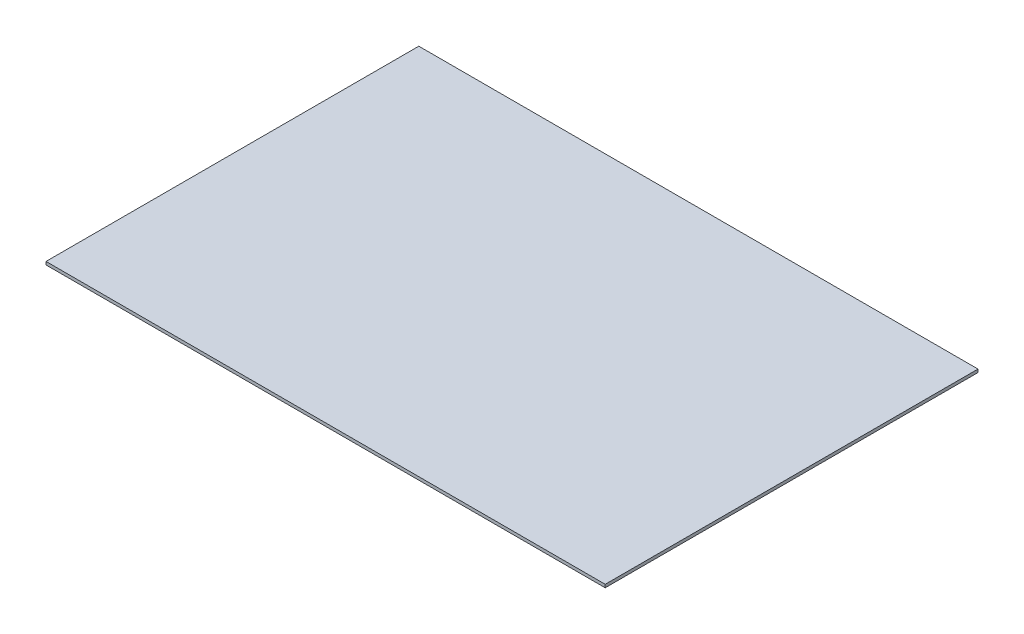
ISO-10303-21;
HEADER;
FILE_DESCRIPTION(('STEP AP214'),'2;1');
FILE_NAME('part.step','',(''),(''),'','','');
FILE_SCHEMA(('AUTOMOTIVE_DESIGN { 1 0 10303 214 1 1 1 1 }'));
ENDSEC;
DATA;
#1=APPLICATION_CONTEXT('core data for automotive mechanical design processes');
#2=APPLICATION_PROTOCOL_DEFINITION('international standard','automotive_design',2000,#1);
#3=PRODUCT_CONTEXT('',#1,'mechanical');
#4=PRODUCT('Part','Part','',(#3));
#5=PRODUCT_RELATED_PRODUCT_CATEGORY('part','',(#4));
#6=PRODUCT_DEFINITION_FORMATION('','',#4);
#7=PRODUCT_DEFINITION_CONTEXT('part definition',#1,'design');
#8=PRODUCT_DEFINITION('design','',#6,#7);
#9=PRODUCT_DEFINITION_SHAPE('','',#8);
#10=(LENGTH_UNIT() NAMED_UNIT(*) SI_UNIT(.MILLI.,.METRE.));
#11=(NAMED_UNIT(*) PLANE_ANGLE_UNIT() SI_UNIT($,.RADIAN.));
#12=(NAMED_UNIT(*) SI_UNIT($,.STERADIAN.) SOLID_ANGLE_UNIT());
#13=UNCERTAINTY_MEASURE_WITH_UNIT(LENGTH_MEASURE(1.E-05),#10,'distance_accuracy_value','');
#14=(GEOMETRIC_REPRESENTATION_CONTEXT(3) GLOBAL_UNCERTAINTY_ASSIGNED_CONTEXT((#13)) GLOBAL_UNIT_ASSIGNED_CONTEXT((#10,
#11,#12)) REPRESENTATION_CONTEXT('',''));
#15=CARTESIAN_POINT('',(0.,0.,0.));
#16=DIRECTION('',(0.,0.,1.));
#17=DIRECTION('',(1.,0.,0.));
#18=AXIS2_PLACEMENT_3D('',#15,#16,#17);
#19=CARTESIAN_POINT('',(914.4,10.,609.6));
#20=DIRECTION('',(-1.,0.,0.));
#21=DIRECTION('',(0.,0.,1.));
#22=AXIS2_PLACEMENT_3D('',#19,#20,#21);
#23=PLANE('',#22);
#24=DIRECTION('',(0.,0.,-1.));
#25=VECTOR('',#24,1.);
#26=CARTESIAN_POINT('',(914.4,0.,609.6));
#27=LINE('',#26,#25);
#28=CARTESIAN_POINT('',(914.4,0.,609.6));
#29=VERTEX_POINT('',#28);
#30=CARTESIAN_POINT('',(914.4,0.,-609.6));
#31=VERTEX_POINT('',#30);
#32=EDGE_CURVE('E98',#29,#31,#27,.T.);
#33=ORIENTED_EDGE('',*,*,#32,.T.);
#34=DIRECTION('',(0.,-1.,0.));
#35=VECTOR('',#34,1.);
#36=CARTESIAN_POINT('',(914.4,10.,-609.6));
#37=LINE('',#36,#35);
#38=CARTESIAN_POINT('',(914.4,10.,-609.6));
#39=VERTEX_POINT('',#38);
#40=EDGE_CURVE('E11',#39,#31,#37,.T.);
#41=ORIENTED_EDGE('',*,*,#40,.F.);
#42=DIRECTION('',(0.,0.,-1.));
#43=VECTOR('',#42,1.);
#44=CARTESIAN_POINT('',(914.4,10.,609.6));
#45=LINE('',#44,#43);
#46=CARTESIAN_POINT('',(914.4,10.,609.6));
#47=VERTEX_POINT('',#46);
#48=EDGE_CURVE('E86',#47,#39,#45,.T.);
#49=ORIENTED_EDGE('',*,*,#48,.F.);
#50=DIRECTION('',(0.,-1.,0.));
#51=VECTOR('',#50,1.);
#52=CARTESIAN_POINT('',(914.4,10.,609.6));
#53=LINE('',#52,#51);
#54=EDGE_CURVE('E94',#47,#29,#53,.T.);
#55=ORIENTED_EDGE('',*,*,#54,.T.);
#56=EDGE_LOOP('',(#33,#41,#49,#55));
#57=FACE_BOUND('',#56,.T.);
#58=ADVANCED_FACE('F35',(#57),#23,.F.);
#59=CARTESIAN_POINT('',(-914.4,10.,-609.6));
#60=DIRECTION('',(0.,0.,1.));
#61=DIRECTION('',(1.,0.,0.));
#62=AXIS2_PLACEMENT_3D('',#59,#60,#61);
#63=PLANE('',#62);
#64=DIRECTION('',(-1.,0.,0.));
#65=VECTOR('',#64,1.);
#66=CARTESIAN_POINT('',(-914.4,0.,-609.6));
#67=LINE('',#66,#65);
#68=CARTESIAN_POINT('',(-914.4,0.,-609.6));
#69=VERTEX_POINT('',#68);
#70=EDGE_CURVE('E90',#31,#69,#67,.T.);
#71=ORIENTED_EDGE('',*,*,#70,.T.);
#72=DIRECTION('',(0.,-1.,0.));
#73=VECTOR('',#72,1.);
#74=CARTESIAN_POINT('',(-914.4,10.,-609.6));
#75=LINE('',#74,#73);
#76=CARTESIAN_POINT('',(-914.4,10.,-609.6));
#77=VERTEX_POINT('',#76);
#78=EDGE_CURVE('E43',#77,#69,#75,.T.);
#79=ORIENTED_EDGE('',*,*,#78,.F.);
#80=DIRECTION('',(-1.,0.,0.));
#81=VECTOR('',#80,1.);
#82=CARTESIAN_POINT('',(-914.4,10.,-609.6));
#83=LINE('',#82,#81);
#84=EDGE_CURVE('E81',#39,#77,#83,.T.);
#85=ORIENTED_EDGE('',*,*,#84,.F.);
#86=ORIENTED_EDGE('',*,*,#40,.T.);
#87=EDGE_LOOP('',(#71,#79,#85,#86));
#88=FACE_BOUND('',#87,.T.);
#89=ADVANCED_FACE('F89',(#88),#63,.F.);
#90=CARTESIAN_POINT('',(-914.4,10.,609.6));
#91=DIRECTION('',(1.,0.,0.));
#92=DIRECTION('',(0.,0.,-1.));
#93=AXIS2_PLACEMENT_3D('',#90,#91,#92);
#94=PLANE('',#93);
#95=DIRECTION('',(0.,0.,1.));
#96=VECTOR('',#95,1.);
#97=CARTESIAN_POINT('',(-914.4,0.,609.6));
#98=LINE('',#97,#96);
#99=CARTESIAN_POINT('',(-914.4,0.,609.6));
#100=VERTEX_POINT('',#99);
#101=EDGE_CURVE('E68',#69,#100,#98,.T.);
#102=ORIENTED_EDGE('',*,*,#101,.T.);
#103=DIRECTION('',(0.,-1.,0.));
#104=VECTOR('',#103,1.);
#105=CARTESIAN_POINT('',(-914.4,10.,609.6));
#106=LINE('',#105,#104);
#107=CARTESIAN_POINT('',(-914.4,10.,609.6));
#108=VERTEX_POINT('',#107);
#109=EDGE_CURVE('E91',#108,#100,#106,.T.);
#110=ORIENTED_EDGE('',*,*,#109,.F.);
#111=DIRECTION('',(0.,0.,1.));
#112=VECTOR('',#111,1.);
#113=CARTESIAN_POINT('',(-914.4,10.,609.6));
#114=LINE('',#113,#112);
#115=EDGE_CURVE('E84',#77,#108,#114,.T.);
#116=ORIENTED_EDGE('',*,*,#115,.F.);
#117=ORIENTED_EDGE('',*,*,#78,.T.);
#118=EDGE_LOOP('',(#102,#110,#116,#117));
#119=FACE_BOUND('',#118,.T.);
#120=ADVANCED_FACE('F92',(#119),#94,.F.);
#121=CARTESIAN_POINT('',(-914.4,10.,609.6));
#122=DIRECTION('',(0.,0.,-1.));
#123=DIRECTION('',(-1.,0.,0.));
#124=AXIS2_PLACEMENT_3D('',#121,#122,#123);
#125=PLANE('',#124);
#126=DIRECTION('',(1.,0.,0.));
#127=VECTOR('',#126,1.);
#128=CARTESIAN_POINT('',(-914.4,0.,609.6));
#129=LINE('',#128,#127);
#130=EDGE_CURVE('E74',#100,#29,#129,.T.);
#131=ORIENTED_EDGE('',*,*,#130,.T.);
#132=ORIENTED_EDGE('',*,*,#54,.F.);
#133=DIRECTION('',(1.,0.,0.));
#134=VECTOR('',#133,1.);
#135=CARTESIAN_POINT('',(-914.4,10.,609.6));
#136=LINE('',#135,#134);
#137=EDGE_CURVE('E51',#108,#47,#136,.T.);
#138=ORIENTED_EDGE('',*,*,#137,.F.);
#139=ORIENTED_EDGE('',*,*,#109,.T.);
#140=EDGE_LOOP('',(#131,#132,#138,#139));
#141=FACE_BOUND('',#140,.T.);
#142=ADVANCED_FACE('F105',(#141),#125,.F.);
#143=CARTESIAN_POINT('',(0.,10.,0.));
#144=DIRECTION('',(0.,-1.,0.));
#145=DIRECTION('',(0.,0.,-1.));
#146=AXIS2_PLACEMENT_3D('',#143,#144,#145);
#147=PLANE('',#146);
#148=ORIENTED_EDGE('',*,*,#48,.T.);
#149=ORIENTED_EDGE('',*,*,#84,.T.);
#150=ORIENTED_EDGE('',*,*,#115,.T.);
#151=ORIENTED_EDGE('',*,*,#137,.T.);
#152=EDGE_LOOP('',(#148,#149,#150,#151));
#153=FACE_BOUND('',#152,.T.);
#154=ADVANCED_FACE('F82',(#153),#147,.F.);
#155=CARTESIAN_POINT('',(0.,0.,0.));
#156=DIRECTION('',(0.,-1.,0.));
#157=DIRECTION('',(0.,0.,-1.));
#158=AXIS2_PLACEMENT_3D('',#155,#156,#157);
#159=PLANE('',#158);
#160=ORIENTED_EDGE('',*,*,#32,.F.);
#161=ORIENTED_EDGE('',*,*,#130,.F.);
#162=ORIENTED_EDGE('',*,*,#101,.F.);
#163=ORIENTED_EDGE('',*,*,#70,.F.);
#164=EDGE_LOOP('',(#160,#161,#162,#163));
#165=FACE_BOUND('',#164,.T.);
#166=ADVANCED_FACE('F108',(#165),#159,.T.);
#167=CLOSED_SHELL('',(#58,#89,#120,#142,#154,#166));
#168=MANIFOLD_SOLID_BREP('B2',#167);
#169=ADVANCED_BREP_SHAPE_REPRESENTATION('',(#18,#168),#14);
#170=SHAPE_DEFINITION_REPRESENTATION(#9,#169);
ENDSEC;
END-ISO-10303-21;
